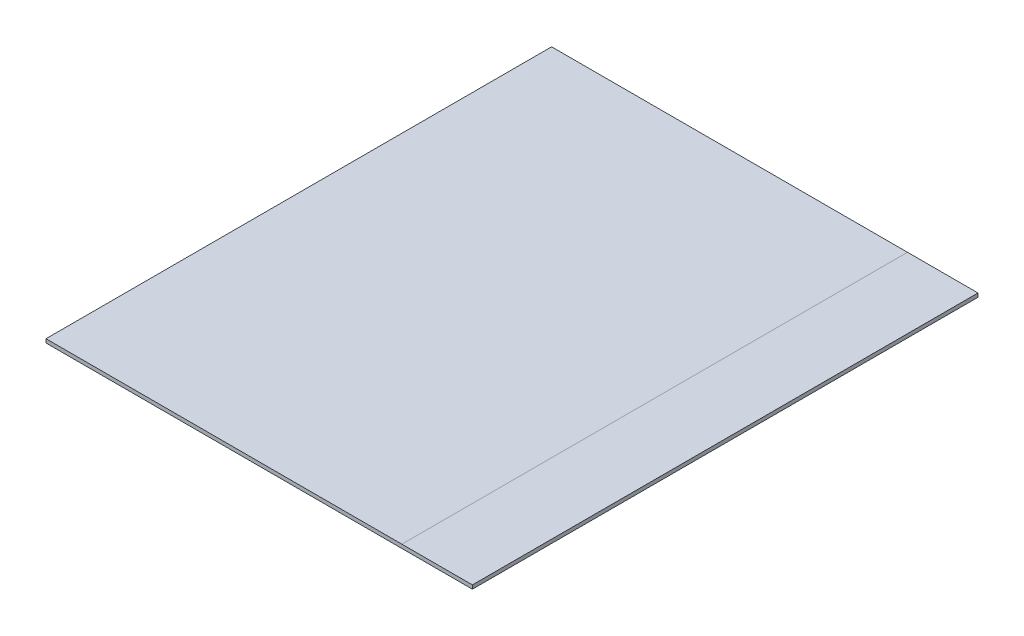
ISO-10303-21;
HEADER;
FILE_DESCRIPTION(('STEP AP214'),'2;1');
FILE_NAME('part.step','',(''),(''),'','','');
FILE_SCHEMA(('AUTOMOTIVE_DESIGN { 1 0 10303 214 1 1 1 1 }'));
ENDSEC;
DATA;
#1=APPLICATION_CONTEXT('core data for automotive mechanical design processes');
#2=APPLICATION_PROTOCOL_DEFINITION('international standard','automotive_design',2000,#1);
#3=PRODUCT_CONTEXT('',#1,'mechanical');
#4=PRODUCT('Part','Part','',(#3));
#5=PRODUCT_RELATED_PRODUCT_CATEGORY('part','',(#4));
#6=PRODUCT_DEFINITION_FORMATION('','',#4);
#7=PRODUCT_DEFINITION_CONTEXT('part definition',#1,'design');
#8=PRODUCT_DEFINITION('design','',#6,#7);
#9=PRODUCT_DEFINITION_SHAPE('','',#8);
#10=(LENGTH_UNIT() NAMED_UNIT(*) SI_UNIT(.MILLI.,.METRE.));
#11=(NAMED_UNIT(*) PLANE_ANGLE_UNIT() SI_UNIT($,.RADIAN.));
#12=(NAMED_UNIT(*) SI_UNIT($,.STERADIAN.) SOLID_ANGLE_UNIT());
#13=UNCERTAINTY_MEASURE_WITH_UNIT(LENGTH_MEASURE(1.E-05),#10,'distance_accuracy_value','');
#14=(GEOMETRIC_REPRESENTATION_CONTEXT(3) GLOBAL_UNCERTAINTY_ASSIGNED_CONTEXT((#13)) GLOBAL_UNIT_ASSIGNED_CONTEXT((#10,
#11,#12)) REPRESENTATION_CONTEXT('',''));
#15=CARTESIAN_POINT('',(0.,0.,0.));
#16=DIRECTION('',(0.,0.,1.));
#17=DIRECTION('',(1.,0.,0.));
#18=AXIS2_PLACEMENT_3D('',#15,#16,#17);
#19=CARTESIAN_POINT('',(0.,3.175,0.));
#20=DIRECTION('',(0.,-1.,0.));
#21=DIRECTION('',(0.,0.,-1.));
#22=AXIS2_PLACEMENT_3D('',#19,#20,#21);
#23=PLANE('',#22);
#24=DIRECTION('',(0.,0.,1.));
#25=VECTOR('',#24,1.);
#26=CARTESIAN_POINT('',(302.8,3.175,0.));
#27=LINE('',#26,#25);
#28=CARTESIAN_POINT('',(302.8,3.175,-430.2));
#29=VERTEX_POINT('',#28);
#30=CARTESIAN_POINT('',(302.8,3.175,0.));
#31=VERTEX_POINT('',#30);
#32=EDGE_CURVE('E11',#29,#31,#27,.T.);
#33=ORIENTED_EDGE('',*,*,#32,.F.);
#34=DIRECTION('',(-1.,0.,0.));
#35=VECTOR('',#34,1.);
#36=CARTESIAN_POINT('',(0.,3.175,-430.2));
#37=LINE('',#36,#35);
#38=CARTESIAN_POINT('',(0.,3.175,-430.2));
#39=VERTEX_POINT('',#38);
#40=EDGE_CURVE('E93',#29,#39,#37,.T.);
#41=ORIENTED_EDGE('',*,*,#40,.T.);
#42=DIRECTION('',(0.,0.,1.));
#43=VECTOR('',#42,1.);
#44=CARTESIAN_POINT('',(0.,3.175,0.));
#45=LINE('',#44,#43);
#46=CARTESIAN_POINT('',(0.,3.175,0.));
#47=VERTEX_POINT('',#46);
#48=EDGE_CURVE('E92',#39,#47,#45,.T.);
#49=ORIENTED_EDGE('',*,*,#48,.T.);
#50=DIRECTION('',(1.,0.,0.));
#51=VECTOR('',#50,1.);
#52=CARTESIAN_POINT('',(0.,3.175,0.));
#53=LINE('',#52,#51);
#54=EDGE_CURVE('E82',#47,#31,#53,.T.);
#55=ORIENTED_EDGE('',*,*,#54,.T.);
#56=EDGE_LOOP('',(#33,#41,#49,#55));
#57=FACE_BOUND('',#56,.T.);
#58=ADVANCED_FACE('F38',(#57),#23,.F.);
#59=CARTESIAN_POINT('',(0.,3.175,0.));
#60=DIRECTION('',(1.,0.,0.));
#61=DIRECTION('',(0.,0.,-1.));
#62=AXIS2_PLACEMENT_3D('',#59,#60,#61);
#63=PLANE('',#62);
#64=DIRECTION('',(0.,0.,1.));
#65=VECTOR('',#64,1.);
#66=CARTESIAN_POINT('',(0.,0.,0.));
#67=LINE('',#66,#65);
#68=CARTESIAN_POINT('',(0.,0.,-430.2));
#69=VERTEX_POINT('',#68);
#70=CARTESIAN_POINT('',(0.,0.,0.));
#71=VERTEX_POINT('',#70);
#72=EDGE_CURVE('E100',#69,#71,#67,.T.);
#73=ORIENTED_EDGE('',*,*,#72,.T.);
#74=DIRECTION('',(0.,-1.,0.));
#75=VECTOR('',#74,1.);
#76=CARTESIAN_POINT('',(0.,3.175,0.));
#77=LINE('',#76,#75);
#78=EDGE_CURVE('E47',#47,#71,#77,.T.);
#79=ORIENTED_EDGE('',*,*,#78,.F.);
#80=ORIENTED_EDGE('',*,*,#48,.F.);
#81=DIRECTION('',(0.,-1.,0.));
#82=VECTOR('',#81,1.);
#83=CARTESIAN_POINT('',(0.,3.175,-430.2));
#84=LINE('',#83,#82);
#85=EDGE_CURVE('E108',#39,#69,#84,.T.);
#86=ORIENTED_EDGE('',*,*,#85,.T.);
#87=EDGE_LOOP('',(#73,#79,#80,#86));
#88=FACE_BOUND('',#87,.T.);
#89=ADVANCED_FACE('F40',(#88),#63,.F.);
#90=CARTESIAN_POINT('',(0.,3.175,0.));
#91=DIRECTION('',(0.,0.,-1.));
#92=DIRECTION('',(-1.,0.,0.));
#93=AXIS2_PLACEMENT_3D('',#90,#91,#92);
#94=PLANE('',#93);
#95=DIRECTION('',(1.,0.,0.));
#96=VECTOR('',#95,1.);
#97=CARTESIAN_POINT('',(0.,0.,0.));
#98=LINE('',#97,#96);
#99=CARTESIAN_POINT('',(362.8,0.,0.));
#100=VERTEX_POINT('',#99);
#101=EDGE_CURVE('E114',#71,#100,#98,.T.);
#102=ORIENTED_EDGE('',*,*,#101,.T.);
#103=DIRECTION('',(0.,-1.,0.));
#104=VECTOR('',#103,1.);
#105=CARTESIAN_POINT('',(362.8,3.175,0.));
#106=LINE('',#105,#104);
#107=CARTESIAN_POINT('',(362.8,3.175,0.));
#108=VERTEX_POINT('',#107);
#109=EDGE_CURVE('E101',#108,#100,#106,.T.);
#110=ORIENTED_EDGE('',*,*,#109,.F.);
#111=EDGE_CURVE('E88',#31,#108,#53,.T.);
#112=ORIENTED_EDGE('',*,*,#111,.F.);
#113=ORIENTED_EDGE('',*,*,#54,.F.);
#114=ORIENTED_EDGE('',*,*,#78,.T.);
#115=EDGE_LOOP('',(#102,#110,#112,#113,#114));
#116=FACE_BOUND('',#115,.T.);
#117=ADVANCED_FACE('F84',(#116),#94,.F.);
#118=CARTESIAN_POINT('',(362.8,3.175,0.));
#119=DIRECTION('',(-1.,0.,0.));
#120=DIRECTION('',(0.,0.,1.));
#121=AXIS2_PLACEMENT_3D('',#118,#119,#120);
#122=PLANE('',#121);
#123=DIRECTION('',(0.,0.,-1.));
#124=VECTOR('',#123,1.);
#125=CARTESIAN_POINT('',(362.8,0.,0.));
#126=LINE('',#125,#124);
#127=CARTESIAN_POINT('',(362.8,0.,-430.2));
#128=VERTEX_POINT('',#127);
#129=EDGE_CURVE('E112',#100,#128,#126,.T.);
#130=ORIENTED_EDGE('',*,*,#129,.T.);
#131=DIRECTION('',(0.,-1.,0.));
#132=VECTOR('',#131,1.);
#133=CARTESIAN_POINT('',(362.8,3.175,-430.2));
#134=LINE('',#133,#132);
#135=CARTESIAN_POINT('',(362.8,3.175,-430.2));
#136=VERTEX_POINT('',#135);
#137=EDGE_CURVE('E103',#136,#128,#134,.T.);
#138=ORIENTED_EDGE('',*,*,#137,.F.);
#139=DIRECTION('',(0.,0.,-1.));
#140=VECTOR('',#139,1.);
#141=CARTESIAN_POINT('',(362.8,3.175,0.));
#142=LINE('',#141,#140);
#143=EDGE_CURVE('E89',#108,#136,#142,.T.);
#144=ORIENTED_EDGE('',*,*,#143,.F.);
#145=ORIENTED_EDGE('',*,*,#109,.T.);
#146=EDGE_LOOP('',(#130,#138,#144,#145));
#147=FACE_BOUND('',#146,.T.);
#148=ADVANCED_FACE('F123',(#147),#122,.F.);
#149=CARTESIAN_POINT('',(0.,3.175,-430.2));
#150=DIRECTION('',(0.,0.,1.));
#151=DIRECTION('',(1.,0.,0.));
#152=AXIS2_PLACEMENT_3D('',#149,#150,#151);
#153=PLANE('',#152);
#154=DIRECTION('',(-1.,0.,0.));
#155=VECTOR('',#154,1.);
#156=CARTESIAN_POINT('',(0.,0.,-430.2));
#157=LINE('',#156,#155);
#158=EDGE_CURVE('E97',#128,#69,#157,.T.);
#159=ORIENTED_EDGE('',*,*,#158,.T.);
#160=ORIENTED_EDGE('',*,*,#85,.F.);
#161=ORIENTED_EDGE('',*,*,#40,.F.);
#162=EDGE_CURVE('E110',#136,#29,#37,.T.);
#163=ORIENTED_EDGE('',*,*,#162,.F.);
#164=ORIENTED_EDGE('',*,*,#137,.T.);
#165=EDGE_LOOP('',(#159,#160,#161,#163,#164));
#166=FACE_BOUND('',#165,.T.);
#167=ADVANCED_FACE('F127',(#166),#153,.F.);
#168=ORIENTED_EDGE('',*,*,#162,.T.);
#169=ORIENTED_EDGE('',*,*,#32,.T.);
#170=ORIENTED_EDGE('',*,*,#111,.T.);
#171=ORIENTED_EDGE('',*,*,#143,.T.);
#172=EDGE_LOOP('',(#168,#169,#170,#171));
#173=FACE_BOUND('',#172,.T.);
#174=ADVANCED_FACE('F120',(#173),#23,.F.);
#175=CARTESIAN_POINT('',(0.,0.,0.));
#176=DIRECTION('',(0.,-1.,0.));
#177=DIRECTION('',(0.,0.,-1.));
#178=AXIS2_PLACEMENT_3D('',#175,#176,#177);
#179=PLANE('',#178);
#180=ORIENTED_EDGE('',*,*,#72,.F.);
#181=ORIENTED_EDGE('',*,*,#158,.F.);
#182=ORIENTED_EDGE('',*,*,#129,.F.);
#183=ORIENTED_EDGE('',*,*,#101,.F.);
#184=EDGE_LOOP('',(#180,#181,#182,#183));
#185=FACE_BOUND('',#184,.T.);
#186=ADVANCED_FACE('F129',(#185),#179,.T.);
#187=CLOSED_SHELL('',(#58,#89,#117,#148,#167,#174,#186));
#188=MANIFOLD_SOLID_BREP('B2',#187);
#189=ADVANCED_BREP_SHAPE_REPRESENTATION('',(#18,#188),#14);
#190=SHAPE_DEFINITION_REPRESENTATION(#9,#189);
ENDSEC;
END-ISO-10303-21;
